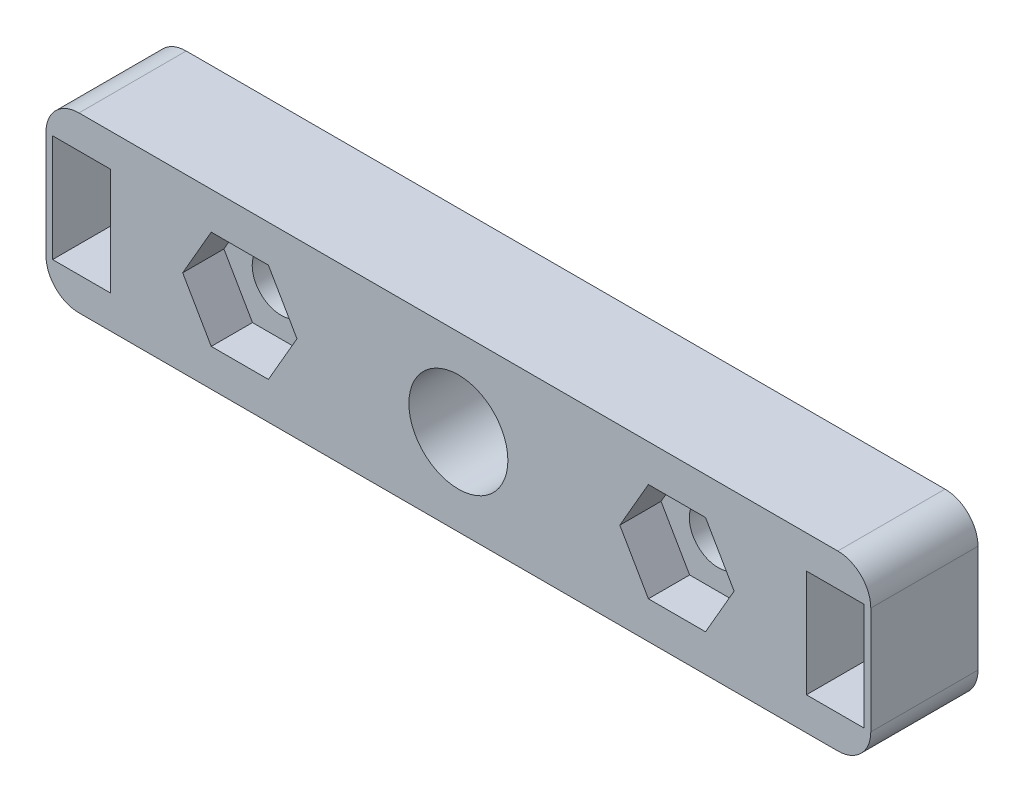
ISO-10303-21;
HEADER;
FILE_DESCRIPTION(('STEP AP214'),'2;1');
FILE_NAME('part.step','',(''),(''),'','','');
FILE_SCHEMA(('AUTOMOTIVE_DESIGN { 1 0 10303 214 1 1 1 1 }'));
ENDSEC;
DATA;
#1=APPLICATION_CONTEXT('core data for automotive mechanical design processes');
#2=APPLICATION_PROTOCOL_DEFINITION('international standard','automotive_design',2000,#1);
#3=PRODUCT_CONTEXT('',#1,'mechanical');
#4=PRODUCT('Part','Part','',(#3));
#5=PRODUCT_RELATED_PRODUCT_CATEGORY('part','',(#4));
#6=PRODUCT_DEFINITION_FORMATION('','',#4);
#7=PRODUCT_DEFINITION_CONTEXT('part definition',#1,'design');
#8=PRODUCT_DEFINITION('design','',#6,#7);
#9=PRODUCT_DEFINITION_SHAPE('','',#8);
#10=(LENGTH_UNIT() NAMED_UNIT(*) SI_UNIT(.MILLI.,.METRE.));
#11=(NAMED_UNIT(*) PLANE_ANGLE_UNIT() SI_UNIT($,.RADIAN.));
#12=(NAMED_UNIT(*) SI_UNIT($,.STERADIAN.) SOLID_ANGLE_UNIT());
#13=UNCERTAINTY_MEASURE_WITH_UNIT(LENGTH_MEASURE(1.E-05),#10,'distance_accuracy_value','');
#14=(GEOMETRIC_REPRESENTATION_CONTEXT(3) GLOBAL_UNCERTAINTY_ASSIGNED_CONTEXT((#13)) GLOBAL_UNIT_ASSIGNED_CONTEXT((#10,
#11,#12)) REPRESENTATION_CONTEXT('',''));
#15=CARTESIAN_POINT('',(0.,0.,0.));
#16=DIRECTION('',(0.,0.,1.));
#17=DIRECTION('',(1.,0.,0.));
#18=AXIS2_PLACEMENT_3D('',#15,#16,#17);
#19=CARTESIAN_POINT('',(0.,0.,17.));
#20=DIRECTION('',(1.,0.,0.));
#21=DIRECTION('',(0.,0.,-1.));
#22=AXIS2_PLACEMENT_3D('',#19,#20,#21);
#23=PLANE('',#22);
#24=DIRECTION('',(0.,-1.,0.));
#25=VECTOR('',#24,1.);
#26=CARTESIAN_POINT('',(0.,0.,6.5));
#27=LINE('',#26,#25);
#28=CARTESIAN_POINT('',(0.,8.5,6.5));
#29=VERTEX_POINT('',#28);
#30=CARTESIAN_POINT('',(0.,2.,6.5));
#31=VERTEX_POINT('',#30);
#32=EDGE_CURVE('E431',#29,#31,#27,.T.);
#33=ORIENTED_EDGE('',*,*,#32,.F.);
#34=DIRECTION('',(0.,0.,-1.));
#35=VECTOR('',#34,1.);
#36=CARTESIAN_POINT('',(0.,8.5,17.));
#37=LINE('',#36,#35);
#38=CARTESIAN_POINT('',(0.,8.5,0.));
#39=VERTEX_POINT('',#38);
#40=EDGE_CURVE('E344',#29,#39,#37,.T.);
#41=ORIENTED_EDGE('',*,*,#40,.T.);
#42=DIRECTION('',(0.,-1.,0.));
#43=VECTOR('',#42,1.);
#44=CARTESIAN_POINT('',(0.,0.,0.));
#45=LINE('',#44,#43);
#46=CARTESIAN_POINT('',(0.,2.,0.));
#47=VERTEX_POINT('',#46);
#48=EDGE_CURVE('E287',#39,#47,#45,.T.);
#49=ORIENTED_EDGE('',*,*,#48,.T.);
#50=DIRECTION('',(0.,0.,-1.));
#51=VECTOR('',#50,1.);
#52=CARTESIAN_POINT('',(0.,2.,17.));
#53=LINE('',#52,#51);
#54=EDGE_CURVE('E346',#47,#31,#53,.F.);
#55=ORIENTED_EDGE('',*,*,#54,.T.);
#56=EDGE_LOOP('',(#33,#41,#49,#55));
#57=FACE_BOUND('',#56,.T.);
#58=ADVANCED_FACE('F32',(#57),#23,.F.);
#59=CARTESIAN_POINT('',(0.,0.,17.));
#60=DIRECTION('',(0.,1.,0.));
#61=DIRECTION('',(0.,0.,1.));
#62=AXIS2_PLACEMENT_3D('',#59,#60,#61);
#63=PLANE('',#62);
#64=DIRECTION('',(1.,0.,0.));
#65=VECTOR('',#64,1.);
#66=CARTESIAN_POINT('',(0.,0.,6.5));
#67=LINE('',#66,#65);
#68=CARTESIAN_POINT('',(2.,0.,6.5));
#69=VERTEX_POINT('',#68);
#70=CARTESIAN_POINT('',(48.,0.,6.5));
#71=VERTEX_POINT('',#70);
#72=EDGE_CURVE('E429',#69,#71,#67,.T.);
#73=ORIENTED_EDGE('',*,*,#72,.F.);
#74=DIRECTION('',(0.,0.,-1.));
#75=VECTOR('',#74,1.);
#76=CARTESIAN_POINT('',(2.,0.,17.));
#77=LINE('',#76,#75);
#78=CARTESIAN_POINT('',(2.,0.,0.));
#79=VERTEX_POINT('',#78);
#80=EDGE_CURVE('E334',#69,#79,#77,.T.);
#81=ORIENTED_EDGE('',*,*,#80,.T.);
#82=DIRECTION('',(1.,0.,0.));
#83=VECTOR('',#82,1.);
#84=CARTESIAN_POINT('',(0.,0.,0.));
#85=LINE('',#84,#83);
#86=CARTESIAN_POINT('',(48.,0.,0.));
#87=VERTEX_POINT('',#86);
#88=EDGE_CURVE('E322',#79,#87,#85,.T.);
#89=ORIENTED_EDGE('',*,*,#88,.T.);
#90=DIRECTION('',(0.,0.,-1.));
#91=VECTOR('',#90,1.);
#92=CARTESIAN_POINT('',(48.,0.,17.));
#93=LINE('',#92,#91);
#94=EDGE_CURVE('E331',#87,#71,#93,.F.);
#95=ORIENTED_EDGE('',*,*,#94,.T.);
#96=EDGE_LOOP('',(#73,#81,#89,#95));
#97=FACE_BOUND('',#96,.T.);
#98=ADVANCED_FACE('F383',(#97),#63,.F.);
#99=CARTESIAN_POINT('',(50.,0.,17.));
#100=DIRECTION('',(-1.,0.,0.));
#101=DIRECTION('',(0.,0.,1.));
#102=AXIS2_PLACEMENT_3D('',#99,#100,#101);
#103=PLANE('',#102);
#104=DIRECTION('',(0.,1.,0.));
#105=VECTOR('',#104,1.);
#106=CARTESIAN_POINT('',(50.,0.,6.5));
#107=LINE('',#106,#105);
#108=CARTESIAN_POINT('',(50.,2.,6.5));
#109=VERTEX_POINT('',#108);
#110=CARTESIAN_POINT('',(50.,8.5,6.5));
#111=VERTEX_POINT('',#110);
#112=EDGE_CURVE('E47',#109,#111,#107,.T.);
#113=ORIENTED_EDGE('',*,*,#112,.F.);
#114=DIRECTION('',(0.,0.,-1.));
#115=VECTOR('',#114,1.);
#116=CARTESIAN_POINT('',(50.,2.,17.));
#117=LINE('',#116,#115);
#118=CARTESIAN_POINT('',(50.,2.,0.));
#119=VERTEX_POINT('',#118);
#120=EDGE_CURVE('E40',#109,#119,#117,.T.);
#121=ORIENTED_EDGE('',*,*,#120,.T.);
#122=DIRECTION('',(0.,1.,0.));
#123=VECTOR('',#122,1.);
#124=CARTESIAN_POINT('',(50.,0.,0.));
#125=LINE('',#124,#123);
#126=CARTESIAN_POINT('',(50.,8.5,0.));
#127=VERTEX_POINT('',#126);
#128=EDGE_CURVE('E325',#119,#127,#125,.T.);
#129=ORIENTED_EDGE('',*,*,#128,.T.);
#130=DIRECTION('',(0.,0.,-1.));
#131=VECTOR('',#130,1.);
#132=CARTESIAN_POINT('',(50.,8.5,17.));
#133=LINE('',#132,#131);
#134=EDGE_CURVE('E354',#127,#111,#133,.F.);
#135=ORIENTED_EDGE('',*,*,#134,.T.);
#136=EDGE_LOOP('',(#113,#121,#129,#135));
#137=FACE_BOUND('',#136,.T.);
#138=ADVANCED_FACE('F389',(#137),#103,.F.);
#139=CARTESIAN_POINT('',(0.,10.5,17.));
#140=DIRECTION('',(0.,-1.,0.));
#141=DIRECTION('',(0.,0.,-1.));
#142=AXIS2_PLACEMENT_3D('',#139,#140,#141);
#143=PLANE('',#142);
#144=DIRECTION('',(-1.,0.,0.));
#145=VECTOR('',#144,1.);
#146=CARTESIAN_POINT('',(0.,10.5,6.5));
#147=LINE('',#146,#145);
#148=CARTESIAN_POINT('',(48.,10.5,6.5));
#149=VERTEX_POINT('',#148);
#150=CARTESIAN_POINT('',(2.,10.5,6.5));
#151=VERTEX_POINT('',#150);
#152=EDGE_CURVE('E419',#149,#151,#147,.T.);
#153=ORIENTED_EDGE('',*,*,#152,.F.);
#154=DIRECTION('',(0.,0.,-1.));
#155=VECTOR('',#154,1.);
#156=CARTESIAN_POINT('',(48.,10.5,17.));
#157=LINE('',#156,#155);
#158=CARTESIAN_POINT('',(48.,10.5,0.));
#159=VERTEX_POINT('',#158);
#160=EDGE_CURVE('E349',#149,#159,#157,.T.);
#161=ORIENTED_EDGE('',*,*,#160,.T.);
#162=DIRECTION('',(-1.,0.,0.));
#163=VECTOR('',#162,1.);
#164=CARTESIAN_POINT('',(0.,10.5,0.));
#165=LINE('',#164,#163);
#166=CARTESIAN_POINT('',(2.,10.5,0.));
#167=VERTEX_POINT('',#166);
#168=EDGE_CURVE('E328',#159,#167,#165,.T.);
#169=ORIENTED_EDGE('',*,*,#168,.T.);
#170=DIRECTION('',(0.,0.,-1.));
#171=VECTOR('',#170,1.);
#172=CARTESIAN_POINT('',(2.,10.5,17.));
#173=LINE('',#172,#171);
#174=EDGE_CURVE('E351',#167,#151,#173,.F.);
#175=ORIENTED_EDGE('',*,*,#174,.T.);
#176=EDGE_LOOP('',(#153,#161,#169,#175));
#177=FACE_BOUND('',#176,.T.);
#178=ADVANCED_FACE('F399',(#177),#143,.F.);
#179=CARTESIAN_POINT('',(2.,2.,17.));
#180=DIRECTION('',(0.,0.,-1.));
#181=DIRECTION('',(-1.,0.,0.));
#182=AXIS2_PLACEMENT_3D('',#179,#180,#181);
#183=CYLINDRICAL_SURFACE('',#182,2.);
#184=ORIENTED_EDGE('',*,*,#80,.F.);
#185=CARTESIAN_POINT('',(2.,2.,6.5));
#186=DIRECTION('',(0.,0.,1.));
#187=DIRECTION('',(1.,0.,0.));
#188=AXIS2_PLACEMENT_3D('',#185,#186,#187);
#189=CIRCLE('',#188,2.);
#190=EDGE_CURVE('E433',#69,#31,#189,.F.);
#191=ORIENTED_EDGE('',*,*,#190,.T.);
#192=ORIENTED_EDGE('',*,*,#54,.F.);
#193=CARTESIAN_POINT('',(2.,2.,0.));
#194=DIRECTION('',(0.,0.,-1.));
#195=DIRECTION('',(-1.,0.,0.));
#196=AXIS2_PLACEMENT_3D('',#193,#194,#195);
#197=CIRCLE('',#196,2.);
#198=EDGE_CURVE('E342',#79,#47,#197,.T.);
#199=ORIENTED_EDGE('',*,*,#198,.F.);
#200=EDGE_LOOP('',(#184,#191,#192,#199));
#201=FACE_BOUND('',#200,.T.);
#202=ADVANCED_FACE('F395',(#201),#183,.T.);
#203=CARTESIAN_POINT('',(2.,8.5,17.));
#204=DIRECTION('',(0.,0.,-1.));
#205=DIRECTION('',(-1.,0.,0.));
#206=AXIS2_PLACEMENT_3D('',#203,#204,#205);
#207=CYLINDRICAL_SURFACE('',#206,2.);
#208=ORIENTED_EDGE('',*,*,#40,.F.);
#209=CARTESIAN_POINT('',(2.,8.5,6.5));
#210=DIRECTION('',(0.,0.,1.));
#211=DIRECTION('',(1.,0.,0.));
#212=AXIS2_PLACEMENT_3D('',#209,#210,#211);
#213=CIRCLE('',#212,2.);
#214=EDGE_CURVE('E421',#29,#151,#213,.F.);
#215=ORIENTED_EDGE('',*,*,#214,.T.);
#216=ORIENTED_EDGE('',*,*,#174,.F.);
#217=CARTESIAN_POINT('',(2.,8.5,0.));
#218=DIRECTION('',(0.,0.,-1.));
#219=DIRECTION('',(-1.,0.,0.));
#220=AXIS2_PLACEMENT_3D('',#217,#218,#219);
#221=CIRCLE('',#220,2.);
#222=EDGE_CURVE('E340',#39,#167,#221,.T.);
#223=ORIENTED_EDGE('',*,*,#222,.F.);
#224=EDGE_LOOP('',(#208,#215,#216,#223));
#225=FACE_BOUND('',#224,.T.);
#226=ADVANCED_FACE('F398',(#225),#207,.T.);
#227=CARTESIAN_POINT('',(48.,2.,17.));
#228=DIRECTION('',(0.,0.,-1.));
#229=DIRECTION('',(-1.,0.,0.));
#230=AXIS2_PLACEMENT_3D('',#227,#228,#229);
#231=CYLINDRICAL_SURFACE('',#230,2.);
#232=ORIENTED_EDGE('',*,*,#120,.F.);
#233=CARTESIAN_POINT('',(48.,2.,6.5));
#234=DIRECTION('',(0.,0.,1.));
#235=DIRECTION('',(1.,0.,0.));
#236=AXIS2_PLACEMENT_3D('',#233,#234,#235);
#237=CIRCLE('',#236,2.);
#238=EDGE_CURVE('E415',#109,#71,#237,.F.);
#239=ORIENTED_EDGE('',*,*,#238,.T.);
#240=ORIENTED_EDGE('',*,*,#94,.F.);
#241=CARTESIAN_POINT('',(48.,2.,0.));
#242=DIRECTION('',(0.,0.,-1.));
#243=DIRECTION('',(-1.,0.,0.));
#244=AXIS2_PLACEMENT_3D('',#241,#242,#243);
#245=CIRCLE('',#244,2.);
#246=EDGE_CURVE('E338',#119,#87,#245,.T.);
#247=ORIENTED_EDGE('',*,*,#246,.F.);
#248=EDGE_LOOP('',(#232,#239,#240,#247));
#249=FACE_BOUND('',#248,.T.);
#250=ADVANCED_FACE('F402',(#249),#231,.T.);
#251=CARTESIAN_POINT('',(48.,8.5,17.));
#252=DIRECTION('',(0.,0.,-1.));
#253=DIRECTION('',(-1.,0.,0.));
#254=AXIS2_PLACEMENT_3D('',#251,#252,#253);
#255=CYLINDRICAL_SURFACE('',#254,2.);
#256=ORIENTED_EDGE('',*,*,#160,.F.);
#257=CARTESIAN_POINT('',(48.,8.5,6.5));
#258=DIRECTION('',(0.,0.,1.));
#259=DIRECTION('',(1.,0.,0.));
#260=AXIS2_PLACEMENT_3D('',#257,#258,#259);
#261=CIRCLE('',#260,2.);
#262=EDGE_CURVE('E423',#149,#111,#261,.F.);
#263=ORIENTED_EDGE('',*,*,#262,.T.);
#264=ORIENTED_EDGE('',*,*,#134,.F.);
#265=CARTESIAN_POINT('',(48.,8.5,0.));
#266=DIRECTION('',(0.,0.,-1.));
#267=DIRECTION('',(-1.,0.,0.));
#268=AXIS2_PLACEMENT_3D('',#265,#266,#267);
#269=CIRCLE('',#268,2.);
#270=EDGE_CURVE('E336',#159,#127,#269,.T.);
#271=ORIENTED_EDGE('',*,*,#270,.F.);
#272=EDGE_LOOP('',(#256,#263,#264,#271));
#273=FACE_BOUND('',#272,.T.);
#274=ADVANCED_FACE('F34',(#273),#255,.T.);
#275=CARTESIAN_POINT('',(25.,5.25,17.));
#276=DIRECTION('',(0.,0.,-1.));
#277=DIRECTION('',(-1.,0.,0.));
#278=AXIS2_PLACEMENT_3D('',#275,#276,#277);
#279=CYLINDRICAL_SURFACE('',#278,3.);
#280=CARTESIAN_POINT('',(25.,5.25,0.));
#281=DIRECTION('',(0.,0.,-1.));
#282=DIRECTION('',(-1.,0.,0.));
#283=AXIS2_PLACEMENT_3D('',#280,#281,#282);
#284=CIRCLE('',#283,3.);
#285=CARTESIAN_POINT('',(22.,5.25,0.));
#286=VERTEX_POINT('',#285);
#287=EDGE_CURVE('E258',#286,#286,#284,.T.);
#288=ORIENTED_EDGE('',*,*,#287,.T.);
#289=EDGE_LOOP('',(#288));
#290=FACE_BOUND('',#289,.T.);
#291=CARTESIAN_POINT('',(25.,5.25,6.5));
#292=DIRECTION('',(0.,0.,1.));
#293=DIRECTION('',(1.,0.,0.));
#294=AXIS2_PLACEMENT_3D('',#291,#292,#293);
#295=CIRCLE('',#294,3.);
#296=CARTESIAN_POINT('',(28.,5.25,6.5));
#297=VERTEX_POINT('',#296);
#298=EDGE_CURVE('E514',#297,#297,#295,.F.);
#299=ORIENTED_EDGE('',*,*,#298,.F.);
#300=EDGE_LOOP('',(#299));
#301=FACE_BOUND('',#300,.T.);
#302=ADVANCED_FACE('F409',(#290,#301),#279,.F.);
#303=CARTESIAN_POINT('',(8.28589838486224,5.25,17.));
#304=DIRECTION('',(0.866025403784438,-0.5,0.));
#305=DIRECTION('',(0.5,0.866025403784438,0.));
#306=AXIS2_PLACEMENT_3D('',#303,#304,#305);
#307=PLANE('',#306);
#308=DIRECTION('',(0.,0.,-1.));
#309=VECTOR('',#308,1.);
#310=CARTESIAN_POINT('',(10.0179491924311,8.24999999999999,17.));
#311=LINE('',#310,#309);
#312=CARTESIAN_POINT('',(10.0179491924311,8.24999999999999,6.5));
#313=VERTEX_POINT('',#312);
#314=CARTESIAN_POINT('',(10.0179491924311,8.24999999999998,4.));
#315=VERTEX_POINT('',#314);
#316=EDGE_CURVE('E253',#313,#315,#311,.T.);
#317=ORIENTED_EDGE('',*,*,#316,.F.);
#318=DIRECTION('',(-0.5,-0.866025403784438,0.));
#319=VECTOR('',#318,1.);
#320=CARTESIAN_POINT('',(8.28589838486224,5.25,6.5));
#321=LINE('',#320,#319);
#322=CARTESIAN_POINT('',(8.28589838486224,5.25,6.5));
#323=VERTEX_POINT('',#322);
#324=EDGE_CURVE('E508',#313,#323,#321,.T.);
#325=ORIENTED_EDGE('',*,*,#324,.T.);
#326=DIRECTION('',(0.,0.,1.));
#327=VECTOR('',#326,1.);
#328=CARTESIAN_POINT('',(8.28589838486226,5.25,4.));
#329=LINE('',#328,#327);
#330=CARTESIAN_POINT('',(8.28589838486226,5.25,4.));
#331=VERTEX_POINT('',#330);
#332=EDGE_CURVE('E473',#331,#323,#329,.T.);
#333=ORIENTED_EDGE('',*,*,#332,.F.);
#334=DIRECTION('',(-0.499999999999999,-0.866025403784439,0.));
#335=VECTOR('',#334,1.);
#336=CARTESIAN_POINT('',(8.28589838486226,5.25,4.));
#337=LINE('',#336,#335);
#338=EDGE_CURVE('E461',#315,#331,#337,.T.);
#339=ORIENTED_EDGE('',*,*,#338,.F.);
#340=EDGE_LOOP('',(#317,#325,#333,#339));
#341=FACE_BOUND('',#340,.T.);
#342=ADVANCED_FACE('F587',(#341),#307,.T.);
#343=CARTESIAN_POINT('',(13.4820508075689,8.24999999999999,17.));
#344=DIRECTION('',(-0.866025403784439,-0.499999999999999,0.));
#345=DIRECTION('',(0.499999999999999,-0.866025403784439,0.));
#346=AXIS2_PLACEMENT_3D('',#343,#344,#345);
#347=PLANE('',#346);
#348=DIRECTION('',(0.,0.,1.));
#349=VECTOR('',#348,1.);
#350=CARTESIAN_POINT('',(15.2141016151377,5.24999999999999,4.));
#351=LINE('',#350,#349);
#352=CARTESIAN_POINT('',(15.2141016151377,5.24999999999999,4.));
#353=VERTEX_POINT('',#352);
#354=CARTESIAN_POINT('',(15.2141016151377,5.24999999999999,6.5));
#355=VERTEX_POINT('',#354);
#356=EDGE_CURVE('E441',#353,#355,#351,.T.);
#357=ORIENTED_EDGE('',*,*,#356,.T.);
#358=DIRECTION('',(-0.499999999999999,0.866025403784439,0.));
#359=VECTOR('',#358,1.);
#360=CARTESIAN_POINT('',(13.4820508075689,8.24999999999999,6.5));
#361=LINE('',#360,#359);
#362=CARTESIAN_POINT('',(13.4820508075689,8.24999999999999,6.5));
#363=VERTEX_POINT('',#362);
#364=EDGE_CURVE('E55',#355,#363,#361,.T.);
#365=ORIENTED_EDGE('',*,*,#364,.T.);
#366=DIRECTION('',(0.,0.,-1.));
#367=VECTOR('',#366,1.);
#368=CARTESIAN_POINT('',(13.4820508075689,8.24999999999999,17.));
#369=LINE('',#368,#367);
#370=CARTESIAN_POINT('',(13.4820508075689,8.24999999999999,4.));
#371=VERTEX_POINT('',#370);
#372=EDGE_CURVE('E246',#363,#371,#369,.T.);
#373=ORIENTED_EDGE('',*,*,#372,.T.);
#374=DIRECTION('',(-0.500000000000001,0.866025403784438,0.));
#375=VECTOR('',#374,1.);
#376=CARTESIAN_POINT('',(13.4820508075689,8.24999999999999,4.));
#377=LINE('',#376,#375);
#378=EDGE_CURVE('E436',#353,#371,#377,.T.);
#379=ORIENTED_EDGE('',*,*,#378,.F.);
#380=EDGE_LOOP('',(#357,#365,#373,#379));
#381=FACE_BOUND('',#380,.T.);
#382=ADVANCED_FACE('F597',(#381),#347,.T.);
#383=CARTESIAN_POINT('',(10.0179491924311,8.24999999999999,17.));
#384=DIRECTION('',(0.,-1.,0.));
#385=DIRECTION('',(0.,0.,-1.));
#386=AXIS2_PLACEMENT_3D('',#383,#384,#385);
#387=PLANE('',#386);
#388=ORIENTED_EDGE('',*,*,#372,.F.);
#389=DIRECTION('',(-1.,0.,0.));
#390=VECTOR('',#389,1.);
#391=CARTESIAN_POINT('',(10.0179491924311,8.24999999999999,6.5));
#392=LINE('',#391,#390);
#393=EDGE_CURVE('E511',#363,#313,#392,.T.);
#394=ORIENTED_EDGE('',*,*,#393,.T.);
#395=ORIENTED_EDGE('',*,*,#316,.T.);
#396=DIRECTION('',(-1.,0.,0.));
#397=VECTOR('',#396,1.);
#398=CARTESIAN_POINT('',(10.0179491924311,8.24999999999998,4.));
#399=LINE('',#398,#397);
#400=EDGE_CURVE('E458',#371,#315,#399,.T.);
#401=ORIENTED_EDGE('',*,*,#400,.F.);
#402=EDGE_LOOP('',(#388,#394,#395,#401));
#403=FACE_BOUND('',#402,.T.);
#404=ADVANCED_FACE('F608',(#403),#387,.T.);
#405=CARTESIAN_POINT('',(10.0179491924311,2.25000000000001,17.));
#406=DIRECTION('',(0.866025403784439,0.5,0.));
#407=DIRECTION('',(-0.5,0.866025403784439,0.));
#408=AXIS2_PLACEMENT_3D('',#405,#406,#407);
#409=PLANE('',#408);
#410=ORIENTED_EDGE('',*,*,#332,.T.);
#411=DIRECTION('',(0.5,-0.866025403784439,0.));
#412=VECTOR('',#411,1.);
#413=CARTESIAN_POINT('',(10.0179491924311,2.25000000000001,6.5));
#414=LINE('',#413,#412);
#415=CARTESIAN_POINT('',(10.0179491924311,2.25000000000001,6.5));
#416=VERTEX_POINT('',#415);
#417=EDGE_CURVE('E504',#323,#416,#414,.T.);
#418=ORIENTED_EDGE('',*,*,#417,.T.);
#419=DIRECTION('',(0.,0.,-1.));
#420=VECTOR('',#419,1.);
#421=CARTESIAN_POINT('',(10.0179491924311,2.25000000000001,17.));
#422=LINE('',#421,#420);
#423=CARTESIAN_POINT('',(10.0179491924311,2.25000000000001,4.));
#424=VERTEX_POINT('',#423);
#425=EDGE_CURVE('E251',#416,#424,#422,.T.);
#426=ORIENTED_EDGE('',*,*,#425,.T.);
#427=DIRECTION('',(0.5,-0.866025403784439,0.));
#428=VECTOR('',#427,1.);
#429=CARTESIAN_POINT('',(10.0179491924311,2.25000000000001,4.));
#430=LINE('',#429,#428);
#431=EDGE_CURVE('E464',#331,#424,#430,.T.);
#432=ORIENTED_EDGE('',*,*,#431,.F.);
#433=EDGE_LOOP('',(#410,#418,#426,#432));
#434=FACE_BOUND('',#433,.T.);
#435=ADVANCED_FACE('F619',(#434),#409,.T.);
#436=CARTESIAN_POINT('',(13.4820508075689,2.25000000000001,17.));
#437=DIRECTION('',(0.,1.,0.));
#438=DIRECTION('',(-1.,0.,0.));
#439=AXIS2_PLACEMENT_3D('',#436,#437,#438);
#440=PLANE('',#439);
#441=ORIENTED_EDGE('',*,*,#425,.F.);
#442=DIRECTION('',(1.,0.,0.));
#443=VECTOR('',#442,1.);
#444=CARTESIAN_POINT('',(13.4820508075689,2.25000000000001,6.5));
#445=LINE('',#444,#443);
#446=CARTESIAN_POINT('',(13.4820508075689,2.25000000000001,6.5));
#447=VERTEX_POINT('',#446);
#448=EDGE_CURVE('E501',#416,#447,#445,.T.);
#449=ORIENTED_EDGE('',*,*,#448,.T.);
#450=DIRECTION('',(0.,0.,-1.));
#451=VECTOR('',#450,1.);
#452=CARTESIAN_POINT('',(13.4820508075689,2.25000000000001,17.));
#453=LINE('',#452,#451);
#454=CARTESIAN_POINT('',(13.4820508075689,2.25000000000001,4.));
#455=VERTEX_POINT('',#454);
#456=EDGE_CURVE('E248',#447,#455,#453,.T.);
#457=ORIENTED_EDGE('',*,*,#456,.T.);
#458=DIRECTION('',(1.,0.,0.));
#459=VECTOR('',#458,1.);
#460=CARTESIAN_POINT('',(13.4820508075689,2.25000000000001,4.));
#461=LINE('',#460,#459);
#462=EDGE_CURVE('E467',#424,#455,#461,.T.);
#463=ORIENTED_EDGE('',*,*,#462,.F.);
#464=EDGE_LOOP('',(#441,#449,#457,#463));
#465=FACE_BOUND('',#464,.T.);
#466=ADVANCED_FACE('F630',(#465),#440,.T.);
#467=CARTESIAN_POINT('',(15.2141016151377,5.25,17.));
#468=DIRECTION('',(-0.866025403784439,0.5,0.));
#469=DIRECTION('',(-0.5,-0.866025403784439,0.));
#470=AXIS2_PLACEMENT_3D('',#467,#468,#469);
#471=PLANE('',#470);
#472=ORIENTED_EDGE('',*,*,#456,.F.);
#473=DIRECTION('',(0.5,0.866025403784439,0.));
#474=VECTOR('',#473,1.);
#475=CARTESIAN_POINT('',(15.2141016151377,5.25,6.5));
#476=LINE('',#475,#474);
#477=EDGE_CURVE('E499',#447,#355,#476,.T.);
#478=ORIENTED_EDGE('',*,*,#477,.T.);
#479=ORIENTED_EDGE('',*,*,#356,.F.);
#480=DIRECTION('',(0.499999999999999,0.866025403784439,0.));
#481=VECTOR('',#480,1.);
#482=CARTESIAN_POINT('',(15.2141016151377,5.24999999999999,4.));
#483=LINE('',#482,#481);
#484=EDGE_CURVE('E470',#455,#353,#483,.T.);
#485=ORIENTED_EDGE('',*,*,#484,.F.);
#486=EDGE_LOOP('',(#472,#478,#479,#485));
#487=FACE_BOUND('',#486,.T.);
#488=ADVANCED_FACE('F641',(#487),#471,.T.);
#489=CARTESIAN_POINT('',(39.9820508075689,8.24999999999999,17.));
#490=DIRECTION('',(0.,-1.,0.));
#491=DIRECTION('',(0.,0.,-1.));
#492=AXIS2_PLACEMENT_3D('',#489,#490,#491);
#493=PLANE('',#492);
#494=DIRECTION('',(0.,0.,-1.));
#495=VECTOR('',#494,1.);
#496=CARTESIAN_POINT('',(39.9820508075689,8.24999999999999,17.));
#497=LINE('',#496,#495);
#498=CARTESIAN_POINT('',(39.9820508075689,8.24999999999999,6.5));
#499=VERTEX_POINT('',#498);
#500=CARTESIAN_POINT('',(39.9820508075689,8.24999999999998,4.));
#501=VERTEX_POINT('',#500);
#502=EDGE_CURVE('E238',#499,#501,#497,.T.);
#503=ORIENTED_EDGE('',*,*,#502,.F.);
#504=DIRECTION('',(-1.,0.,0.));
#505=VECTOR('',#504,1.);
#506=CARTESIAN_POINT('',(39.9820508075689,8.24999999999999,6.5));
#507=LINE('',#506,#505);
#508=CARTESIAN_POINT('',(36.5179491924311,8.24999999999999,6.5));
#509=VERTEX_POINT('',#508);
#510=EDGE_CURVE('E483',#499,#509,#507,.T.);
#511=ORIENTED_EDGE('',*,*,#510,.T.);
#512=DIRECTION('',(0.,0.,-1.));
#513=VECTOR('',#512,1.);
#514=CARTESIAN_POINT('',(36.5179491924311,8.24999999999999,17.));
#515=LINE('',#514,#513);
#516=CARTESIAN_POINT('',(36.5179491924311,8.24999999999999,4.));
#517=VERTEX_POINT('',#516);
#518=EDGE_CURVE('E242',#509,#517,#515,.T.);
#519=ORIENTED_EDGE('',*,*,#518,.T.);
#520=DIRECTION('',(-1.,0.,0.));
#521=VECTOR('',#520,1.);
#522=CARTESIAN_POINT('',(39.9820508075689,8.24999999999998,4.));
#523=LINE('',#522,#521);
#524=EDGE_CURVE('E447',#501,#517,#523,.T.);
#525=ORIENTED_EDGE('',*,*,#524,.F.);
#526=EDGE_LOOP('',(#503,#511,#519,#525));
#527=FACE_BOUND('',#526,.T.);
#528=ADVANCED_FACE('F482',(#527),#493,.T.);
#529=CARTESIAN_POINT('',(41.7141016151378,5.25,17.));
#530=DIRECTION('',(-0.866025403784438,-0.5,0.));
#531=DIRECTION('',(0.5,-0.866025403784438,0.));
#532=AXIS2_PLACEMENT_3D('',#529,#530,#531);
#533=PLANE('',#532);
#534=DIRECTION('',(0.,0.,1.));
#535=VECTOR('',#534,1.);
#536=CARTESIAN_POINT('',(41.7141016151377,5.25,4.));
#537=LINE('',#536,#535);
#538=CARTESIAN_POINT('',(41.7141016151377,5.25,4.));
#539=VERTEX_POINT('',#538);
#540=CARTESIAN_POINT('',(41.7141016151377,5.25,6.5));
#541=VERTEX_POINT('',#540);
#542=EDGE_CURVE('E453',#539,#541,#537,.T.);
#543=ORIENTED_EDGE('',*,*,#542,.T.);
#544=DIRECTION('',(-0.5,0.866025403784438,0.));
#545=VECTOR('',#544,1.);
#546=CARTESIAN_POINT('',(41.7141016151378,5.25,6.5));
#547=LINE('',#546,#545);
#548=EDGE_CURVE('E221',#541,#499,#547,.T.);
#549=ORIENTED_EDGE('',*,*,#548,.T.);
#550=ORIENTED_EDGE('',*,*,#502,.T.);
#551=DIRECTION('',(-0.499999999999999,0.866025403784439,0.));
#552=VECTOR('',#551,1.);
#553=CARTESIAN_POINT('',(41.7141016151377,5.25,4.));
#554=LINE('',#553,#552);
#555=EDGE_CURVE('E444',#539,#501,#554,.T.);
#556=ORIENTED_EDGE('',*,*,#555,.F.);
#557=EDGE_LOOP('',(#543,#549,#550,#556));
#558=FACE_BOUND('',#557,.T.);
#559=ADVANCED_FACE('F662',(#558),#533,.T.);
#560=CARTESIAN_POINT('',(36.5179491924311,8.24999999999999,17.));
#561=DIRECTION('',(0.866025403784439,-0.499999999999999,0.));
#562=DIRECTION('',(0.499999999999999,0.866025403784439,0.));
#563=AXIS2_PLACEMENT_3D('',#560,#561,#562);
#564=PLANE('',#563);
#565=ORIENTED_EDGE('',*,*,#518,.F.);
#566=DIRECTION('',(-0.499999999999999,-0.866025403784439,0.));
#567=VECTOR('',#566,1.);
#568=CARTESIAN_POINT('',(36.5179491924311,8.24999999999999,6.5));
#569=LINE('',#568,#567);
#570=CARTESIAN_POINT('',(34.7858983848623,5.24999999999999,6.5));
#571=VERTEX_POINT('',#570);
#572=EDGE_CURVE('E491',#509,#571,#569,.T.);
#573=ORIENTED_EDGE('',*,*,#572,.T.);
#574=DIRECTION('',(0.,0.,1.));
#575=VECTOR('',#574,1.);
#576=CARTESIAN_POINT('',(34.7858983848623,5.24999999999999,4.));
#577=LINE('',#576,#575);
#578=CARTESIAN_POINT('',(34.7858983848623,5.24999999999999,4.));
#579=VERTEX_POINT('',#578);
#580=EDGE_CURVE('E360',#579,#571,#577,.T.);
#581=ORIENTED_EDGE('',*,*,#580,.F.);
#582=DIRECTION('',(-0.500000000000001,-0.866025403784438,0.));
#583=VECTOR('',#582,1.);
#584=CARTESIAN_POINT('',(36.5179491924311,8.24999999999999,4.));
#585=LINE('',#584,#583);
#586=EDGE_CURVE('E450',#517,#579,#585,.T.);
#587=ORIENTED_EDGE('',*,*,#586,.F.);
#588=EDGE_LOOP('',(#565,#573,#581,#587));
#589=FACE_BOUND('',#588,.T.);
#590=ADVANCED_FACE('F489',(#589),#564,.T.);
#591=CARTESIAN_POINT('',(34.7858983848623,5.25,17.));
#592=DIRECTION('',(0.866025403784439,0.5,0.));
#593=DIRECTION('',(-0.5,0.866025403784439,0.));
#594=AXIS2_PLACEMENT_3D('',#591,#592,#593);
#595=PLANE('',#594);
#596=ORIENTED_EDGE('',*,*,#580,.T.);
#597=DIRECTION('',(0.5,-0.866025403784439,0.));
#598=VECTOR('',#597,1.);
#599=CARTESIAN_POINT('',(34.7858983848623,5.25,6.5));
#600=LINE('',#599,#598);
#601=CARTESIAN_POINT('',(36.5179491924311,2.25000000000001,6.5));
#602=VERTEX_POINT('',#601);
#603=EDGE_CURVE('E232',#571,#602,#600,.T.);
#604=ORIENTED_EDGE('',*,*,#603,.T.);
#605=DIRECTION('',(0.,0.,-1.));
#606=VECTOR('',#605,1.);
#607=CARTESIAN_POINT('',(36.5179491924311,2.25000000000001,17.));
#608=LINE('',#607,#606);
#609=CARTESIAN_POINT('',(36.5179491924311,2.25000000000001,4.));
#610=VERTEX_POINT('',#609);
#611=EDGE_CURVE('E231',#602,#610,#608,.T.);
#612=ORIENTED_EDGE('',*,*,#611,.T.);
#613=DIRECTION('',(0.499999999999999,-0.866025403784439,0.));
#614=VECTOR('',#613,1.);
#615=CARTESIAN_POINT('',(34.7858983848623,5.24999999999999,4.));
#616=LINE('',#615,#614);
#617=EDGE_CURVE('E437',#579,#610,#616,.T.);
#618=ORIENTED_EDGE('',*,*,#617,.F.);
#619=EDGE_LOOP('',(#596,#604,#612,#618));
#620=FACE_BOUND('',#619,.T.);
#621=ADVANCED_FACE('F493',(#620),#595,.T.);
#622=CARTESIAN_POINT('',(36.5179491924311,2.25000000000001,17.));
#623=DIRECTION('',(0.,1.,0.));
#624=DIRECTION('',(-1.,0.,0.));
#625=AXIS2_PLACEMENT_3D('',#622,#623,#624);
#626=PLANE('',#625);
#627=ORIENTED_EDGE('',*,*,#611,.F.);
#628=DIRECTION('',(1.,0.,0.));
#629=VECTOR('',#628,1.);
#630=CARTESIAN_POINT('',(36.5179491924311,2.25000000000001,6.5));
#631=LINE('',#630,#629);
#632=CARTESIAN_POINT('',(39.9820508075689,2.25,6.5));
#633=VERTEX_POINT('',#632);
#634=EDGE_CURVE('E218',#602,#633,#631,.T.);
#635=ORIENTED_EDGE('',*,*,#634,.T.);
#636=DIRECTION('',(0.,0.,-1.));
#637=VECTOR('',#636,1.);
#638=CARTESIAN_POINT('',(39.9820508075689,2.25000000000001,17.));
#639=LINE('',#638,#637);
#640=CARTESIAN_POINT('',(39.9820508075689,2.25,4.));
#641=VERTEX_POINT('',#640);
#642=EDGE_CURVE('E229',#633,#641,#639,.T.);
#643=ORIENTED_EDGE('',*,*,#642,.T.);
#644=DIRECTION('',(1.,0.,0.));
#645=VECTOR('',#644,1.);
#646=CARTESIAN_POINT('',(36.5179491924311,2.25000000000001,4.));
#647=LINE('',#646,#645);
#648=EDGE_CURVE('E440',#610,#641,#647,.T.);
#649=ORIENTED_EDGE('',*,*,#648,.F.);
#650=EDGE_LOOP('',(#627,#635,#643,#649));
#651=FACE_BOUND('',#650,.T.);
#652=ADVANCED_FACE('F227',(#651),#626,.T.);
#653=CARTESIAN_POINT('',(39.9820508075689,2.25000000000001,17.));
#654=DIRECTION('',(-0.866025403784439,0.5,0.));
#655=DIRECTION('',(-0.5,-0.866025403784439,0.));
#656=AXIS2_PLACEMENT_3D('',#653,#654,#655);
#657=PLANE('',#656);
#658=ORIENTED_EDGE('',*,*,#642,.F.);
#659=DIRECTION('',(0.5,0.866025403784439,0.));
#660=VECTOR('',#659,1.);
#661=CARTESIAN_POINT('',(39.9820508075689,2.25000000000001,6.5));
#662=LINE('',#661,#660);
#663=EDGE_CURVE('E11',#633,#541,#662,.T.);
#664=ORIENTED_EDGE('',*,*,#663,.T.);
#665=ORIENTED_EDGE('',*,*,#542,.F.);
#666=DIRECTION('',(0.5,0.866025403784439,0.));
#667=VECTOR('',#666,1.);
#668=CARTESIAN_POINT('',(39.9820508075689,2.25,4.));
#669=LINE('',#668,#667);
#670=EDGE_CURVE('E236',#641,#539,#669,.T.);
#671=ORIENTED_EDGE('',*,*,#670,.F.);
#672=EDGE_LOOP('',(#658,#664,#665,#671));
#673=FACE_BOUND('',#672,.T.);
#674=ADVANCED_FACE('F234',(#673),#657,.T.);
#675=CARTESIAN_POINT('',(38.25,5.25,17.));
#676=DIRECTION('',(0.,0.,-1.));
#677=DIRECTION('',(-1.,0.,0.));
#678=AXIS2_PLACEMENT_3D('',#675,#676,#677);
#679=CYLINDRICAL_SURFACE('',#678,1.75);
#680=CARTESIAN_POINT('',(38.25,5.25,0.));
#681=DIRECTION('',(0.,0.,-1.));
#682=DIRECTION('',(-1.,0.,0.));
#683=AXIS2_PLACEMENT_3D('',#680,#681,#682);
#684=CIRCLE('',#683,1.75);
#685=CARTESIAN_POINT('',(36.5,5.25,0.));
#686=VERTEX_POINT('',#685);
#687=EDGE_CURVE('E240',#686,#686,#684,.T.);
#688=ORIENTED_EDGE('',*,*,#687,.T.);
#689=EDGE_LOOP('',(#688));
#690=FACE_BOUND('',#689,.T.);
#691=CARTESIAN_POINT('',(38.25,5.25,4.));
#692=DIRECTION('',(0.,0.,1.));
#693=DIRECTION('',(1.,0.,0.));
#694=AXIS2_PLACEMENT_3D('',#691,#692,#693);
#695=CIRCLE('',#694,1.75);
#696=CARTESIAN_POINT('',(40.,5.25,4.));
#697=VERTEX_POINT('',#696);
#698=EDGE_CURVE('E358',#697,#697,#695,.F.);
#699=ORIENTED_EDGE('',*,*,#698,.F.);
#700=EDGE_LOOP('',(#699));
#701=FACE_BOUND('',#700,.T.);
#702=ADVANCED_FACE('F534',(#690,#701),#679,.F.);
#703=CARTESIAN_POINT('',(0.,0.,0.));
#704=DIRECTION('',(0.,0.,-1.));
#705=DIRECTION('',(-1.,0.,0.));
#706=AXIS2_PLACEMENT_3D('',#703,#704,#705);
#707=PLANE('',#706);
#708=ORIENTED_EDGE('',*,*,#687,.F.);
#709=EDGE_LOOP('',(#708));
#710=FACE_BOUND('',#709,.T.);
#711=CARTESIAN_POINT('',(11.75,5.25,0.));
#712=DIRECTION('',(0.,0.,-1.));
#713=DIRECTION('',(-1.,0.,0.));
#714=AXIS2_PLACEMENT_3D('',#711,#712,#713);
#715=CIRCLE('',#714,1.75);
#716=CARTESIAN_POINT('',(10.,5.25,0.));
#717=VERTEX_POINT('',#716);
#718=EDGE_CURVE('E255',#717,#717,#715,.T.);
#719=ORIENTED_EDGE('',*,*,#718,.F.);
#720=EDGE_LOOP('',(#719));
#721=FACE_BOUND('',#720,.T.);
#722=ORIENTED_EDGE('',*,*,#287,.F.);
#723=EDGE_LOOP('',(#722));
#724=FACE_BOUND('',#723,.T.);
#725=DIRECTION('',(0.,1.,0.));
#726=VECTOR('',#725,1.);
#727=CARTESIAN_POINT('',(0.400000000000002,8.50000000000001,0.));
#728=LINE('',#727,#726);
#729=CARTESIAN_POINT('',(0.400000000000002,2.00000000000001,0.));
#730=VERTEX_POINT('',#729);
#731=CARTESIAN_POINT('',(0.400000000000002,8.50000000000001,0.));
#732=VERTEX_POINT('',#731);
#733=EDGE_CURVE('E274',#730,#732,#728,.T.);
#734=ORIENTED_EDGE('',*,*,#733,.F.);
#735=DIRECTION('',(-1.,0.,0.));
#736=VECTOR('',#735,1.);
#737=CARTESIAN_POINT('',(0.400000000000002,2.00000000000001,0.));
#738=LINE('',#737,#736);
#739=CARTESIAN_POINT('',(3.9,2.00000000000001,0.));
#740=VERTEX_POINT('',#739);
#741=EDGE_CURVE('E267',#740,#730,#738,.T.);
#742=ORIENTED_EDGE('',*,*,#741,.F.);
#743=DIRECTION('',(0.,-1.,0.));
#744=VECTOR('',#743,1.);
#745=CARTESIAN_POINT('',(3.9,8.50000000000001,0.));
#746=LINE('',#745,#744);
#747=CARTESIAN_POINT('',(3.9,8.50000000000001,0.));
#748=VERTEX_POINT('',#747);
#749=EDGE_CURVE('E280',#748,#740,#746,.T.);
#750=ORIENTED_EDGE('',*,*,#749,.F.);
#751=DIRECTION('',(1.,0.,0.));
#752=VECTOR('',#751,1.);
#753=CARTESIAN_POINT('',(0.400000000000002,8.50000000000001,0.));
#754=LINE('',#753,#752);
#755=EDGE_CURVE('E276',#732,#748,#754,.T.);
#756=ORIENTED_EDGE('',*,*,#755,.F.);
#757=EDGE_LOOP('',(#734,#742,#750,#756));
#758=FACE_BOUND('',#757,.T.);
#759=DIRECTION('',(1.,0.,0.));
#760=VECTOR('',#759,1.);
#761=CARTESIAN_POINT('',(49.6,8.5,0.));
#762=LINE('',#761,#760);
#763=CARTESIAN_POINT('',(46.1,8.5,0.));
#764=VERTEX_POINT('',#763);
#765=CARTESIAN_POINT('',(49.6,8.5,0.));
#766=VERTEX_POINT('',#765);
#767=EDGE_CURVE('E263',#764,#766,#762,.T.);
#768=ORIENTED_EDGE('',*,*,#767,.F.);
#769=DIRECTION('',(0.,1.,0.));
#770=VECTOR('',#769,1.);
#771=CARTESIAN_POINT('',(46.1,8.5,0.));
#772=LINE('',#771,#770);
#773=CARTESIAN_POINT('',(46.1,2.,0.));
#774=VERTEX_POINT('',#773);
#775=EDGE_CURVE('E297',#774,#764,#772,.T.);
#776=ORIENTED_EDGE('',*,*,#775,.F.);
#777=DIRECTION('',(-1.,0.,0.));
#778=VECTOR('',#777,1.);
#779=CARTESIAN_POINT('',(49.6,2.,0.));
#780=LINE('',#779,#778);
#781=CARTESIAN_POINT('',(49.6,2.,0.));
#782=VERTEX_POINT('',#781);
#783=EDGE_CURVE('E308',#782,#774,#780,.T.);
#784=ORIENTED_EDGE('',*,*,#783,.F.);
#785=DIRECTION('',(0.,-1.,0.));
#786=VECTOR('',#785,1.);
#787=CARTESIAN_POINT('',(49.6,8.5,0.));
#788=LINE('',#787,#786);
#789=EDGE_CURVE('E305',#766,#782,#788,.T.);
#790=ORIENTED_EDGE('',*,*,#789,.F.);
#791=EDGE_LOOP('',(#768,#776,#784,#790));
#792=FACE_BOUND('',#791,.T.);
#793=ORIENTED_EDGE('',*,*,#88,.F.);
#794=ORIENTED_EDGE('',*,*,#198,.T.);
#795=ORIENTED_EDGE('',*,*,#48,.F.);
#796=ORIENTED_EDGE('',*,*,#222,.T.);
#797=ORIENTED_EDGE('',*,*,#168,.F.);
#798=ORIENTED_EDGE('',*,*,#270,.T.);
#799=ORIENTED_EDGE('',*,*,#128,.F.);
#800=ORIENTED_EDGE('',*,*,#246,.T.);
#801=EDGE_LOOP('',(#793,#794,#795,#796,#797,#798,#799,#800));
#802=FACE_BOUND('',#801,.T.);
#803=ADVANCED_FACE('F531',(#710,#721,#724,#758,#792,#802),#707,.T.);
#804=CARTESIAN_POINT('',(49.6,8.5,6.5));
#805=DIRECTION('',(0.,1.,0.));
#806=DIRECTION('',(0.,0.,1.));
#807=AXIS2_PLACEMENT_3D('',#804,#805,#806);
#808=PLANE('',#807);
#809=ORIENTED_EDGE('',*,*,#767,.T.);
#810=DIRECTION('',(0.,0.,-1.));
#811=VECTOR('',#810,1.);
#812=CARTESIAN_POINT('',(49.6,8.5,6.5));
#813=LINE('',#812,#811);
#814=CARTESIAN_POINT('',(49.6,8.5,6.5));
#815=VERTEX_POINT('',#814);
#816=EDGE_CURVE('E303',#815,#766,#813,.T.);
#817=ORIENTED_EDGE('',*,*,#816,.F.);
#818=DIRECTION('',(1.,0.,0.));
#819=VECTOR('',#818,1.);
#820=CARTESIAN_POINT('',(49.6,8.5,6.5));
#821=LINE('',#820,#819);
#822=CARTESIAN_POINT('',(46.1,8.5,6.5));
#823=VERTEX_POINT('',#822);
#824=EDGE_CURVE('E294',#823,#815,#821,.T.);
#825=ORIENTED_EDGE('',*,*,#824,.F.);
#826=DIRECTION('',(0.,0.,-1.));
#827=VECTOR('',#826,1.);
#828=CARTESIAN_POINT('',(46.1,8.5,6.5));
#829=LINE('',#828,#827);
#830=EDGE_CURVE('E277',#823,#764,#829,.T.);
#831=ORIENTED_EDGE('',*,*,#830,.T.);
#832=EDGE_LOOP('',(#809,#817,#825,#831));
#833=FACE_BOUND('',#832,.T.);
#834=ADVANCED_FACE('F533',(#833),#808,.F.);
#835=CARTESIAN_POINT('',(46.1,8.5,6.5));
#836=DIRECTION('',(-1.,0.,0.));
#837=DIRECTION('',(0.,0.,1.));
#838=AXIS2_PLACEMENT_3D('',#835,#836,#837);
#839=PLANE('',#838);
#840=ORIENTED_EDGE('',*,*,#775,.T.);
#841=ORIENTED_EDGE('',*,*,#830,.F.);
#842=DIRECTION('',(0.,1.,0.));
#843=VECTOR('',#842,1.);
#844=CARTESIAN_POINT('',(46.1,8.5,6.5));
#845=LINE('',#844,#843);
#846=CARTESIAN_POINT('',(46.1,2.,6.5));
#847=VERTEX_POINT('',#846);
#848=EDGE_CURVE('E301',#847,#823,#845,.T.);
#849=ORIENTED_EDGE('',*,*,#848,.F.);
#850=DIRECTION('',(0.,0.,-1.));
#851=VECTOR('',#850,1.);
#852=CARTESIAN_POINT('',(46.1,2.,6.5));
#853=LINE('',#852,#851);
#854=EDGE_CURVE('E314',#847,#774,#853,.T.);
#855=ORIENTED_EDGE('',*,*,#854,.T.);
#856=EDGE_LOOP('',(#840,#841,#849,#855));
#857=FACE_BOUND('',#856,.T.);
#858=ADVANCED_FACE('F541',(#857),#839,.F.);
#859=CARTESIAN_POINT('',(49.6,2.,6.5));
#860=DIRECTION('',(0.,-1.,0.));
#861=DIRECTION('',(0.,0.,-1.));
#862=AXIS2_PLACEMENT_3D('',#859,#860,#861);
#863=PLANE('',#862);
#864=ORIENTED_EDGE('',*,*,#783,.T.);
#865=ORIENTED_EDGE('',*,*,#854,.F.);
#866=DIRECTION('',(-1.,0.,0.));
#867=VECTOR('',#866,1.);
#868=CARTESIAN_POINT('',(49.6,2.,6.5));
#869=LINE('',#868,#867);
#870=CARTESIAN_POINT('',(49.6,2.,6.5));
#871=VERTEX_POINT('',#870);
#872=EDGE_CURVE('E299',#871,#847,#869,.T.);
#873=ORIENTED_EDGE('',*,*,#872,.F.);
#874=DIRECTION('',(0.,0.,-1.));
#875=VECTOR('',#874,1.);
#876=CARTESIAN_POINT('',(49.6,2.,6.5));
#877=LINE('',#876,#875);
#878=EDGE_CURVE('E316',#871,#782,#877,.T.);
#879=ORIENTED_EDGE('',*,*,#878,.T.);
#880=EDGE_LOOP('',(#864,#865,#873,#879));
#881=FACE_BOUND('',#880,.T.);
#882=ADVANCED_FACE('F724',(#881),#863,.F.);
#883=CARTESIAN_POINT('',(49.6,8.5,6.5));
#884=DIRECTION('',(1.,0.,0.));
#885=DIRECTION('',(0.,0.,-1.));
#886=AXIS2_PLACEMENT_3D('',#883,#884,#885);
#887=PLANE('',#886);
#888=ORIENTED_EDGE('',*,*,#789,.T.);
#889=ORIENTED_EDGE('',*,*,#878,.F.);
#890=DIRECTION('',(0.,-1.,0.));
#891=VECTOR('',#890,1.);
#892=CARTESIAN_POINT('',(49.6,8.5,6.5));
#893=LINE('',#892,#891);
#894=EDGE_CURVE('E296',#815,#871,#893,.T.);
#895=ORIENTED_EDGE('',*,*,#894,.F.);
#896=ORIENTED_EDGE('',*,*,#816,.T.);
#897=EDGE_LOOP('',(#888,#889,#895,#896));
#898=FACE_BOUND('',#897,.T.);
#899=ADVANCED_FACE('F734',(#898),#887,.F.);
#900=CARTESIAN_POINT('',(0.400000000000002,8.50000000000001,6.5));
#901=DIRECTION('',(-1.,0.,0.));
#902=DIRECTION('',(0.,0.,1.));
#903=AXIS2_PLACEMENT_3D('',#900,#901,#902);
#904=PLANE('',#903);
#905=ORIENTED_EDGE('',*,*,#733,.T.);
#906=DIRECTION('',(0.,0.,-1.));
#907=VECTOR('',#906,1.);
#908=CARTESIAN_POINT('',(0.400000000000002,8.50000000000001,6.5));
#909=LINE('',#908,#907);
#910=CARTESIAN_POINT('',(0.400000000000002,8.50000000000001,6.5));
#911=VERTEX_POINT('',#910);
#912=EDGE_CURVE('E273',#911,#732,#909,.T.);
#913=ORIENTED_EDGE('',*,*,#912,.F.);
#914=DIRECTION('',(0.,1.,0.));
#915=VECTOR('',#914,1.);
#916=CARTESIAN_POINT('',(0.400000000000002,8.50000000000001,6.5));
#917=LINE('',#916,#915);
#918=CARTESIAN_POINT('',(0.400000000000002,2.00000000000001,6.5));
#919=VERTEX_POINT('',#918);
#920=EDGE_CURVE('E264',#919,#911,#917,.T.);
#921=ORIENTED_EDGE('',*,*,#920,.F.);
#922=DIRECTION('',(0.,0.,-1.));
#923=VECTOR('',#922,1.);
#924=CARTESIAN_POINT('',(0.400000000000002,2.00000000000001,6.5));
#925=LINE('',#924,#923);
#926=EDGE_CURVE('E285',#919,#730,#925,.T.);
#927=ORIENTED_EDGE('',*,*,#926,.T.);
#928=EDGE_LOOP('',(#905,#913,#921,#927));
#929=FACE_BOUND('',#928,.T.);
#930=ADVANCED_FACE('F744',(#929),#904,.F.);
#931=CARTESIAN_POINT('',(0.400000000000002,2.00000000000001,6.5));
#932=DIRECTION('',(0.,-1.,0.));
#933=DIRECTION('',(0.,0.,-1.));
#934=AXIS2_PLACEMENT_3D('',#931,#932,#933);
#935=PLANE('',#934);
#936=ORIENTED_EDGE('',*,*,#741,.T.);
#937=ORIENTED_EDGE('',*,*,#926,.F.);
#938=DIRECTION('',(-1.,0.,0.));
#939=VECTOR('',#938,1.);
#940=CARTESIAN_POINT('',(0.400000000000002,2.00000000000001,6.5));
#941=LINE('',#940,#939);
#942=CARTESIAN_POINT('',(3.9,2.00000000000001,6.5));
#943=VERTEX_POINT('',#942);
#944=EDGE_CURVE('E271',#943,#919,#941,.T.);
#945=ORIENTED_EDGE('',*,*,#944,.F.);
#946=DIRECTION('',(0.,0.,-1.));
#947=VECTOR('',#946,1.);
#948=CARTESIAN_POINT('',(3.9,2.00000000000001,6.5));
#949=LINE('',#948,#947);
#950=EDGE_CURVE('E288',#943,#740,#949,.T.);
#951=ORIENTED_EDGE('',*,*,#950,.T.);
#952=EDGE_LOOP('',(#936,#937,#945,#951));
#953=FACE_BOUND('',#952,.T.);
#954=ADVANCED_FACE('F753',(#953),#935,.F.);
#955=CARTESIAN_POINT('',(3.9,8.50000000000001,6.5));
#956=DIRECTION('',(1.,0.,0.));
#957=DIRECTION('',(0.,0.,-1.));
#958=AXIS2_PLACEMENT_3D('',#955,#956,#957);
#959=PLANE('',#958);
#960=ORIENTED_EDGE('',*,*,#749,.T.);
#961=ORIENTED_EDGE('',*,*,#950,.F.);
#962=DIRECTION('',(0.,-1.,0.));
#963=VECTOR('',#962,1.);
#964=CARTESIAN_POINT('',(3.9,8.50000000000001,6.5));
#965=LINE('',#964,#963);
#966=CARTESIAN_POINT('',(3.9,8.50000000000001,6.5));
#967=VERTEX_POINT('',#966);
#968=EDGE_CURVE('E269',#967,#943,#965,.T.);
#969=ORIENTED_EDGE('',*,*,#968,.F.);
#970=DIRECTION('',(0.,0.,-1.));
#971=VECTOR('',#970,1.);
#972=CARTESIAN_POINT('',(3.9,8.50000000000001,6.5));
#973=LINE('',#972,#971);
#974=EDGE_CURVE('E290',#967,#748,#973,.T.);
#975=ORIENTED_EDGE('',*,*,#974,.T.);
#976=EDGE_LOOP('',(#960,#961,#969,#975));
#977=FACE_BOUND('',#976,.T.);
#978=ADVANCED_FACE('F763',(#977),#959,.F.);
#979=CARTESIAN_POINT('',(0.400000000000002,8.50000000000001,6.5));
#980=DIRECTION('',(0.,1.,0.));
#981=DIRECTION('',(0.,0.,1.));
#982=AXIS2_PLACEMENT_3D('',#979,#980,#981);
#983=PLANE('',#982);
#984=ORIENTED_EDGE('',*,*,#755,.T.);
#985=ORIENTED_EDGE('',*,*,#974,.F.);
#986=DIRECTION('',(1.,0.,0.));
#987=VECTOR('',#986,1.);
#988=CARTESIAN_POINT('',(0.400000000000002,8.50000000000001,6.5));
#989=LINE('',#988,#987);
#990=EDGE_CURVE('E266',#911,#967,#989,.T.);
#991=ORIENTED_EDGE('',*,*,#990,.F.);
#992=ORIENTED_EDGE('',*,*,#912,.T.);
#993=EDGE_LOOP('',(#984,#985,#991,#992));
#994=FACE_BOUND('',#993,.T.);
#995=ADVANCED_FACE('F773',(#994),#983,.F.);
#996=CARTESIAN_POINT('',(11.75,5.25,17.));
#997=DIRECTION('',(0.,0.,-1.));
#998=DIRECTION('',(-1.,0.,0.));
#999=AXIS2_PLACEMENT_3D('',#996,#997,#998);
#1000=CYLINDRICAL_SURFACE('',#999,1.75);
#1001=CARTESIAN_POINT('',(11.75,5.25,4.));
#1002=DIRECTION('',(0.,0.,-1.));
#1003=DIRECTION('',(-1.,0.,0.));
#1004=AXIS2_PLACEMENT_3D('',#1001,#1002,#1003);
#1005=CIRCLE('',#1004,1.75);
#1006=CARTESIAN_POINT('',(10.,5.25,4.));
#1007=VERTEX_POINT('',#1006);
#1008=EDGE_CURVE('E249',#1007,#1007,#1005,.F.);
#1009=ORIENTED_EDGE('',*,*,#1008,.T.);
#1010=EDGE_LOOP('',(#1009));
#1011=FACE_BOUND('',#1010,.T.);
#1012=ORIENTED_EDGE('',*,*,#718,.T.);
#1013=EDGE_LOOP('',(#1012));
#1014=FACE_BOUND('',#1013,.T.);
#1015=ADVANCED_FACE('F364',(#1011,#1014),#1000,.F.);
#1016=CARTESIAN_POINT('',(0.,0.,4.));
#1017=DIRECTION('',(0.,0.,1.));
#1018=DIRECTION('',(1.,0.,0.));
#1019=AXIS2_PLACEMENT_3D('',#1016,#1017,#1018);
#1020=PLANE('',#1019);
#1021=ORIENTED_EDGE('',*,*,#617,.T.);
#1022=ORIENTED_EDGE('',*,*,#648,.T.);
#1023=ORIENTED_EDGE('',*,*,#670,.T.);
#1024=ORIENTED_EDGE('',*,*,#555,.T.);
#1025=ORIENTED_EDGE('',*,*,#524,.T.);
#1026=ORIENTED_EDGE('',*,*,#586,.T.);
#1027=EDGE_LOOP('',(#1021,#1022,#1023,#1024,#1025,#1026));
#1028=FACE_BOUND('',#1027,.T.);
#1029=ORIENTED_EDGE('',*,*,#698,.T.);
#1030=EDGE_LOOP('',(#1029));
#1031=FACE_BOUND('',#1030,.T.);
#1032=ADVANCED_FACE('F369',(#1028,#1031),#1020,.T.);
#1033=CARTESIAN_POINT('',(0.,0.,4.));
#1034=DIRECTION('',(0.,0.,-1.));
#1035=DIRECTION('',(-1.,0.,0.));
#1036=AXIS2_PLACEMENT_3D('',#1033,#1034,#1035);
#1037=PLANE('',#1036);
#1038=ORIENTED_EDGE('',*,*,#378,.T.);
#1039=ORIENTED_EDGE('',*,*,#400,.T.);
#1040=ORIENTED_EDGE('',*,*,#338,.T.);
#1041=ORIENTED_EDGE('',*,*,#431,.T.);
#1042=ORIENTED_EDGE('',*,*,#462,.T.);
#1043=ORIENTED_EDGE('',*,*,#484,.T.);
#1044=EDGE_LOOP('',(#1038,#1039,#1040,#1041,#1042,#1043));
#1045=FACE_BOUND('',#1044,.T.);
#1046=ORIENTED_EDGE('',*,*,#1008,.F.);
#1047=EDGE_LOOP('',(#1046));
#1048=FACE_BOUND('',#1047,.T.);
#1049=ADVANCED_FACE('F367',(#1045,#1048),#1037,.F.);
#1050=CARTESIAN_POINT('',(0.,0.,6.5));
#1051=DIRECTION('',(0.,0.,1.));
#1052=DIRECTION('',(1.,0.,0.));
#1053=AXIS2_PLACEMENT_3D('',#1050,#1051,#1052);
#1054=PLANE('',#1053);
#1055=ORIENTED_EDGE('',*,*,#920,.T.);
#1056=ORIENTED_EDGE('',*,*,#990,.T.);
#1057=ORIENTED_EDGE('',*,*,#968,.T.);
#1058=ORIENTED_EDGE('',*,*,#944,.T.);
#1059=EDGE_LOOP('',(#1055,#1056,#1057,#1058));
#1060=FACE_BOUND('',#1059,.T.);
#1061=ORIENTED_EDGE('',*,*,#72,.T.);
#1062=ORIENTED_EDGE('',*,*,#238,.F.);
#1063=ORIENTED_EDGE('',*,*,#112,.T.);
#1064=ORIENTED_EDGE('',*,*,#262,.F.);
#1065=ORIENTED_EDGE('',*,*,#152,.T.);
#1066=ORIENTED_EDGE('',*,*,#214,.F.);
#1067=ORIENTED_EDGE('',*,*,#32,.T.);
#1068=ORIENTED_EDGE('',*,*,#190,.F.);
#1069=EDGE_LOOP('',(#1061,#1062,#1063,#1064,#1065,#1066,#1067,#1068));
#1070=FACE_BOUND('',#1069,.T.);
#1071=ORIENTED_EDGE('',*,*,#364,.F.);
#1072=ORIENTED_EDGE('',*,*,#477,.F.);
#1073=ORIENTED_EDGE('',*,*,#448,.F.);
#1074=ORIENTED_EDGE('',*,*,#417,.F.);
#1075=ORIENTED_EDGE('',*,*,#324,.F.);
#1076=ORIENTED_EDGE('',*,*,#393,.F.);
#1077=EDGE_LOOP('',(#1071,#1072,#1073,#1074,#1075,#1076));
#1078=FACE_BOUND('',#1077,.T.);
#1079=ORIENTED_EDGE('',*,*,#548,.F.);
#1080=ORIENTED_EDGE('',*,*,#663,.F.);
#1081=ORIENTED_EDGE('',*,*,#634,.F.);
#1082=ORIENTED_EDGE('',*,*,#603,.F.);
#1083=ORIENTED_EDGE('',*,*,#572,.F.);
#1084=ORIENTED_EDGE('',*,*,#510,.F.);
#1085=EDGE_LOOP('',(#1079,#1080,#1081,#1082,#1083,#1084));
#1086=FACE_BOUND('',#1085,.T.);
#1087=ORIENTED_EDGE('',*,*,#298,.T.);
#1088=EDGE_LOOP('',(#1087));
#1089=FACE_BOUND('',#1088,.T.);
#1090=ORIENTED_EDGE('',*,*,#824,.T.);
#1091=ORIENTED_EDGE('',*,*,#894,.T.);
#1092=ORIENTED_EDGE('',*,*,#872,.T.);
#1093=ORIENTED_EDGE('',*,*,#848,.T.);
#1094=EDGE_LOOP('',(#1090,#1091,#1092,#1093));
#1095=FACE_BOUND('',#1094,.T.);
#1096=ADVANCED_FACE('F216',(#1060,#1070,#1078,#1086,#1089,#1095),#1054,.T.);
#1097=CLOSED_SHELL('',(#58,#98,#138,#178,#202,#226,#250,#274,#302,#342,#382,#404,#435,#466,#488,
#528,#559,#590,#621,#652,#674,#702,#803,#834,#858,#882,#899,#930,#954,#978,#995,#1015,#1032,
#1049,#1096));
#1098=MANIFOLD_SOLID_BREP('B2',#1097);
#1099=ADVANCED_BREP_SHAPE_REPRESENTATION('',(#18,#1098),#14);
#1100=SHAPE_DEFINITION_REPRESENTATION(#9,#1099);
ENDSEC;
END-ISO-10303-21;
